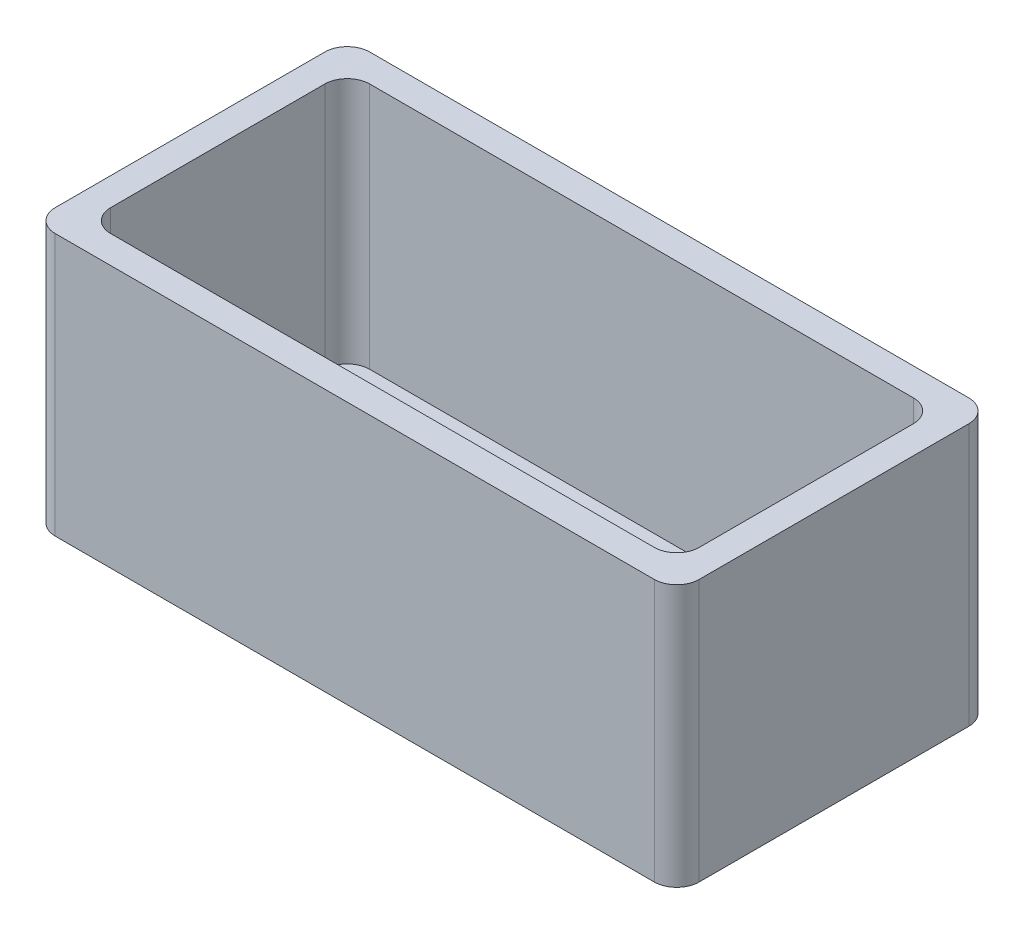
ISO-10303-21;
HEADER;
FILE_DESCRIPTION(('STEP AP214'),'2;1');
FILE_NAME('part.step','',(''),(''),'','','');
FILE_SCHEMA(('AUTOMOTIVE_DESIGN { 1 0 10303 214 1 1 1 1 }'));
ENDSEC;
DATA;
#1=APPLICATION_CONTEXT('core data for automotive mechanical design processes');
#2=APPLICATION_PROTOCOL_DEFINITION('international standard','automotive_design',2000,#1);
#3=PRODUCT_CONTEXT('',#1,'mechanical');
#4=PRODUCT('Part','Part','',(#3));
#5=PRODUCT_RELATED_PRODUCT_CATEGORY('part','',(#4));
#6=PRODUCT_DEFINITION_FORMATION('','',#4);
#7=PRODUCT_DEFINITION_CONTEXT('part definition',#1,'design');
#8=PRODUCT_DEFINITION('design','',#6,#7);
#9=PRODUCT_DEFINITION_SHAPE('','',#8);
#10=(LENGTH_UNIT() NAMED_UNIT(*) SI_UNIT(.MILLI.,.METRE.));
#11=(NAMED_UNIT(*) PLANE_ANGLE_UNIT() SI_UNIT($,.RADIAN.));
#12=(NAMED_UNIT(*) SI_UNIT($,.STERADIAN.) SOLID_ANGLE_UNIT());
#13=UNCERTAINTY_MEASURE_WITH_UNIT(LENGTH_MEASURE(1.E-05),#10,'distance_accuracy_value','');
#14=(GEOMETRIC_REPRESENTATION_CONTEXT(3) GLOBAL_UNCERTAINTY_ASSIGNED_CONTEXT((#13)) GLOBAL_UNIT_ASSIGNED_CONTEXT((#10,
#11,#12)) REPRESENTATION_CONTEXT('',''));
#15=CARTESIAN_POINT('',(0.,0.,0.));
#16=DIRECTION('',(0.,0.,1.));
#17=DIRECTION('',(1.,0.,0.));
#18=AXIS2_PLACEMENT_3D('',#15,#16,#17);
#19=CARTESIAN_POINT('',(0.,35.,0.));
#20=DIRECTION('',(0.,-1.,0.));
#21=DIRECTION('',(0.,0.,-1.));
#22=AXIS2_PLACEMENT_3D('',#19,#20,#21);
#23=PLANE('',#22);
#24=CARTESIAN_POINT('',(79.3,35.,-6.7));
#25=DIRECTION('',(0.,1.,0.));
#26=DIRECTION('',(0.,0.,1.));
#27=AXIS2_PLACEMENT_3D('',#24,#25,#26);
#28=CIRCLE('',#27,3.);
#29=CARTESIAN_POINT('',(79.3,35.,-3.7));
#30=VERTEX_POINT('',#29);
#31=CARTESIAN_POINT('',(82.3,35.,-6.7));
#32=VERTEX_POINT('',#31);
#33=EDGE_CURVE('E378',#30,#32,#28,.T.);
#34=ORIENTED_EDGE('',*,*,#33,.F.);
#35=DIRECTION('',(1.,0.,0.));
#36=VECTOR('',#35,1.);
#37=CARTESIAN_POINT('',(6.70000000000002,35.,-3.7));
#38=LINE('',#37,#36);
#39=CARTESIAN_POINT('',(6.70000000000002,35.,-3.7));
#40=VERTEX_POINT('',#39);
#41=EDGE_CURVE('E167',#40,#30,#38,.T.);
#42=ORIENTED_EDGE('',*,*,#41,.F.);
#43=CARTESIAN_POINT('',(6.7,35.,-6.7));
#44=DIRECTION('',(0.,1.,0.));
#45=DIRECTION('',(0.,0.,-1.));
#46=AXIS2_PLACEMENT_3D('',#43,#44,#45);
#47=CIRCLE('',#46,3.);
#48=CARTESIAN_POINT('',(3.7,35.,-6.70000000000002));
#49=VERTEX_POINT('',#48);
#50=EDGE_CURVE('E179',#49,#40,#47,.T.);
#51=ORIENTED_EDGE('',*,*,#50,.F.);
#52=DIRECTION('',(0.,0.,1.));
#53=VECTOR('',#52,1.);
#54=CARTESIAN_POINT('',(3.7,35.,-35.3));
#55=LINE('',#54,#53);
#56=CARTESIAN_POINT('',(3.7,35.,-35.3));
#57=VERTEX_POINT('',#56);
#58=EDGE_CURVE('E50',#57,#49,#55,.T.);
#59=ORIENTED_EDGE('',*,*,#58,.F.);
#60=CARTESIAN_POINT('',(6.7,35.,-35.3));
#61=DIRECTION('',(0.,1.,0.));
#62=DIRECTION('',(0.,0.,1.));
#63=AXIS2_PLACEMENT_3D('',#60,#61,#62);
#64=CIRCLE('',#63,3.);
#65=CARTESIAN_POINT('',(6.70000000000002,35.,-38.3));
#66=VERTEX_POINT('',#65);
#67=EDGE_CURVE('E175',#66,#57,#64,.T.);
#68=ORIENTED_EDGE('',*,*,#67,.F.);
#69=DIRECTION('',(-1.,0.,0.));
#70=VECTOR('',#69,1.);
#71=CARTESIAN_POINT('',(79.3,35.,-38.3));
#72=LINE('',#71,#70);
#73=CARTESIAN_POINT('',(79.3,35.,-38.3));
#74=VERTEX_POINT('',#73);
#75=EDGE_CURVE('E387',#74,#66,#72,.T.);
#76=ORIENTED_EDGE('',*,*,#75,.F.);
#77=CARTESIAN_POINT('',(79.3,35.,-35.3));
#78=DIRECTION('',(0.,1.,0.));
#79=DIRECTION('',(0.,0.,1.));
#80=AXIS2_PLACEMENT_3D('',#77,#78,#79);
#81=CIRCLE('',#80,3.);
#82=CARTESIAN_POINT('',(82.3,35.,-35.3));
#83=VERTEX_POINT('',#82);
#84=EDGE_CURVE('E384',#83,#74,#81,.T.);
#85=ORIENTED_EDGE('',*,*,#84,.F.);
#86=DIRECTION('',(0.,0.,-1.));
#87=VECTOR('',#86,1.);
#88=CARTESIAN_POINT('',(82.3,35.,-6.7));
#89=LINE('',#88,#87);
#90=EDGE_CURVE('E379',#32,#83,#89,.T.);
#91=ORIENTED_EDGE('',*,*,#90,.F.);
#92=EDGE_LOOP('',(#34,#42,#51,#59,#68,#76,#85,#91));
#93=FACE_BOUND('',#92,.T.);
#94=DIRECTION('',(1.,0.,0.));
#95=VECTOR('',#94,1.);
#96=CARTESIAN_POINT('',(0.,35.,0.));
#97=LINE('',#96,#95);
#98=CARTESIAN_POINT('',(3.,35.,0.));
#99=VERTEX_POINT('',#98);
#100=CARTESIAN_POINT('',(83.,35.,0.));
#101=VERTEX_POINT('',#100);
#102=EDGE_CURVE('E221',#99,#101,#97,.T.);
#103=ORIENTED_EDGE('',*,*,#102,.T.);
#104=CARTESIAN_POINT('',(83.,35.,-3.));
#105=DIRECTION('',(0.,-1.,0.));
#106=DIRECTION('',(0.,0.,-1.));
#107=AXIS2_PLACEMENT_3D('',#104,#105,#106);
#108=CIRCLE('',#107,3.);
#109=CARTESIAN_POINT('',(86.,35.,-3.));
#110=VERTEX_POINT('',#109);
#111=EDGE_CURVE('E263',#101,#110,#108,.F.);
#112=ORIENTED_EDGE('',*,*,#111,.T.);
#113=DIRECTION('',(0.,0.,-1.));
#114=VECTOR('',#113,1.);
#115=CARTESIAN_POINT('',(86.,35.,0.));
#116=LINE('',#115,#114);
#117=CARTESIAN_POINT('',(86.,35.,-39.));
#118=VERTEX_POINT('',#117);
#119=EDGE_CURVE('E225',#110,#118,#116,.T.);
#120=ORIENTED_EDGE('',*,*,#119,.T.);
#121=CARTESIAN_POINT('',(83.,35.,-39.));
#122=DIRECTION('',(0.,-1.,0.));
#123=DIRECTION('',(0.,0.,-1.));
#124=AXIS2_PLACEMENT_3D('',#121,#122,#123);
#125=CIRCLE('',#124,3.);
#126=CARTESIAN_POINT('',(83.,35.,-42.));
#127=VERTEX_POINT('',#126);
#128=EDGE_CURVE('E261',#118,#127,#125,.F.);
#129=ORIENTED_EDGE('',*,*,#128,.T.);
#130=DIRECTION('',(-1.,0.,0.));
#131=VECTOR('',#130,1.);
#132=CARTESIAN_POINT('',(0.,35.,-42.));
#133=LINE('',#132,#131);
#134=CARTESIAN_POINT('',(3.,35.,-42.));
#135=VERTEX_POINT('',#134);
#136=EDGE_CURVE('E228',#127,#135,#133,.T.);
#137=ORIENTED_EDGE('',*,*,#136,.T.);
#138=CARTESIAN_POINT('',(3.,35.,-39.));
#139=DIRECTION('',(0.,-1.,0.));
#140=DIRECTION('',(0.,0.,-1.));
#141=AXIS2_PLACEMENT_3D('',#138,#139,#140);
#142=CIRCLE('',#141,3.);
#143=CARTESIAN_POINT('',(0.,35.,-39.));
#144=VERTEX_POINT('',#143);
#145=EDGE_CURVE('E259',#135,#144,#142,.F.);
#146=ORIENTED_EDGE('',*,*,#145,.T.);
#147=DIRECTION('',(0.,0.,1.));
#148=VECTOR('',#147,1.);
#149=CARTESIAN_POINT('',(0.,35.,0.));
#150=LINE('',#149,#148);
#151=CARTESIAN_POINT('',(0.,35.,-3.));
#152=VERTEX_POINT('',#151);
#153=EDGE_CURVE('E218',#144,#152,#150,.T.);
#154=ORIENTED_EDGE('',*,*,#153,.T.);
#155=CARTESIAN_POINT('',(3.,35.,-3.));
#156=DIRECTION('',(0.,-1.,0.));
#157=DIRECTION('',(0.,0.,-1.));
#158=AXIS2_PLACEMENT_3D('',#155,#156,#157);
#159=CIRCLE('',#158,3.);
#160=EDGE_CURVE('E257',#152,#99,#159,.F.);
#161=ORIENTED_EDGE('',*,*,#160,.T.);
#162=EDGE_LOOP('',(#103,#112,#120,#129,#137,#146,#154,#161));
#163=FACE_BOUND('',#162,.T.);
#164=ADVANCED_FACE('F34',(#93,#163),#23,.F.);
#165=CARTESIAN_POINT('',(0.,0.,0.));
#166=DIRECTION('',(0.,-1.,0.));
#167=DIRECTION('',(0.,0.,-1.));
#168=AXIS2_PLACEMENT_3D('',#165,#166,#167);
#169=PLANE('',#168);
#170=CARTESIAN_POINT('',(8.99999999999999,0.,-10.));
#171=DIRECTION('',(0.,1.,0.));
#172=DIRECTION('',(0.,0.,1.));
#173=AXIS2_PLACEMENT_3D('',#170,#171,#172);
#174=CIRCLE('',#173,1.5);
#175=CARTESIAN_POINT('',(8.99999999999999,0.,-8.5));
#176=VERTEX_POINT('',#175);
#177=EDGE_CURVE('E214',#176,#176,#174,.T.);
#178=ORIENTED_EDGE('',*,*,#177,.T.);
#179=EDGE_LOOP('',(#178));
#180=FACE_BOUND('',#179,.T.);
#181=DIRECTION('',(0.,0.,-1.));
#182=VECTOR('',#181,1.);
#183=CARTESIAN_POINT('',(86.,0.,0.));
#184=LINE('',#183,#182);
#185=CARTESIAN_POINT('',(86.,0.,-3.));
#186=VERTEX_POINT('',#185);
#187=CARTESIAN_POINT('',(86.,0.,-39.));
#188=VERTEX_POINT('',#187);
#189=EDGE_CURVE('E236',#186,#188,#184,.T.);
#190=ORIENTED_EDGE('',*,*,#189,.F.);
#191=CARTESIAN_POINT('',(83.,0.,-3.));
#192=DIRECTION('',(0.,-1.,0.));
#193=DIRECTION('',(0.,0.,-1.));
#194=AXIS2_PLACEMENT_3D('',#191,#192,#193);
#195=CIRCLE('',#194,3.);
#196=CARTESIAN_POINT('',(83.,0.,0.));
#197=VERTEX_POINT('',#196);
#198=EDGE_CURVE('E250',#186,#197,#195,.T.);
#199=ORIENTED_EDGE('',*,*,#198,.T.);
#200=DIRECTION('',(1.,0.,0.));
#201=VECTOR('',#200,1.);
#202=CARTESIAN_POINT('',(0.,0.,0.));
#203=LINE('',#202,#201);
#204=CARTESIAN_POINT('',(3.,0.,0.));
#205=VERTEX_POINT('',#204);
#206=EDGE_CURVE('E233',#205,#197,#203,.T.);
#207=ORIENTED_EDGE('',*,*,#206,.F.);
#208=CARTESIAN_POINT('',(3.,0.,-3.));
#209=DIRECTION('',(0.,-1.,0.));
#210=DIRECTION('',(0.,0.,-1.));
#211=AXIS2_PLACEMENT_3D('',#208,#209,#210);
#212=CIRCLE('',#211,3.);
#213=CARTESIAN_POINT('',(0.,0.,-3.));
#214=VERTEX_POINT('',#213);
#215=EDGE_CURVE('E244',#205,#214,#212,.T.);
#216=ORIENTED_EDGE('',*,*,#215,.T.);
#217=DIRECTION('',(0.,0.,1.));
#218=VECTOR('',#217,1.);
#219=CARTESIAN_POINT('',(0.,0.,0.));
#220=LINE('',#219,#218);
#221=CARTESIAN_POINT('',(0.,0.,-39.));
#222=VERTEX_POINT('',#221);
#223=EDGE_CURVE('E217',#222,#214,#220,.T.);
#224=ORIENTED_EDGE('',*,*,#223,.F.);
#225=CARTESIAN_POINT('',(3.,0.,-39.));
#226=DIRECTION('',(0.,-1.,0.));
#227=DIRECTION('',(0.,0.,-1.));
#228=AXIS2_PLACEMENT_3D('',#225,#226,#227);
#229=CIRCLE('',#228,3.);
#230=CARTESIAN_POINT('',(3.,0.,-42.));
#231=VERTEX_POINT('',#230);
#232=EDGE_CURVE('E246',#222,#231,#229,.T.);
#233=ORIENTED_EDGE('',*,*,#232,.T.);
#234=DIRECTION('',(-1.,0.,0.));
#235=VECTOR('',#234,1.);
#236=CARTESIAN_POINT('',(0.,0.,-42.));
#237=LINE('',#236,#235);
#238=CARTESIAN_POINT('',(83.,0.,-42.));
#239=VERTEX_POINT('',#238);
#240=EDGE_CURVE('E222',#239,#231,#237,.T.);
#241=ORIENTED_EDGE('',*,*,#240,.F.);
#242=CARTESIAN_POINT('',(83.,0.,-39.));
#243=DIRECTION('',(0.,-1.,0.));
#244=DIRECTION('',(0.,0.,-1.));
#245=AXIS2_PLACEMENT_3D('',#242,#243,#244);
#246=CIRCLE('',#245,3.);
#247=EDGE_CURVE('E248',#239,#188,#246,.T.);
#248=ORIENTED_EDGE('',*,*,#247,.T.);
#249=EDGE_LOOP('',(#190,#199,#207,#216,#224,#233,#241,#248));
#250=FACE_BOUND('',#249,.T.);
#251=CARTESIAN_POINT('',(77.,0.,-10.));
#252=DIRECTION('',(0.,1.,0.));
#253=DIRECTION('',(0.,0.,1.));
#254=AXIS2_PLACEMENT_3D('',#251,#252,#253);
#255=CIRCLE('',#254,1.5);
#256=CARTESIAN_POINT('',(77.,0.,-8.50000000000001));
#257=VERTEX_POINT('',#256);
#258=EDGE_CURVE('E211',#257,#257,#255,.T.);
#259=ORIENTED_EDGE('',*,*,#258,.T.);
#260=EDGE_LOOP('',(#259));
#261=FACE_BOUND('',#260,.T.);
#262=ADVANCED_FACE('F287',(#180,#250,#261),#169,.T.);
#263=CARTESIAN_POINT('',(0.,35.,0.));
#264=DIRECTION('',(1.,0.,0.));
#265=DIRECTION('',(0.,0.,-1.));
#266=AXIS2_PLACEMENT_3D('',#263,#264,#265);
#267=PLANE('',#266);
#268=ORIENTED_EDGE('',*,*,#153,.F.);
#269=DIRECTION('',(0.,-1.,0.));
#270=VECTOR('',#269,1.);
#271=CARTESIAN_POINT('',(0.,35.,-39.));
#272=LINE('',#271,#270);
#273=EDGE_CURVE('E12',#144,#222,#272,.T.);
#274=ORIENTED_EDGE('',*,*,#273,.T.);
#275=ORIENTED_EDGE('',*,*,#223,.T.);
#276=DIRECTION('',(0.,-1.,0.));
#277=VECTOR('',#276,1.);
#278=CARTESIAN_POINT('',(0.,35.,-3.));
#279=LINE('',#278,#277);
#280=EDGE_CURVE('E43',#214,#152,#279,.F.);
#281=ORIENTED_EDGE('',*,*,#280,.T.);
#282=EDGE_LOOP('',(#268,#274,#275,#281));
#283=FACE_BOUND('',#282,.T.);
#284=ADVANCED_FACE('F272',(#283),#267,.F.);
#285=CARTESIAN_POINT('',(0.,35.,0.));
#286=DIRECTION('',(0.,0.,-1.));
#287=DIRECTION('',(-1.,0.,0.));
#288=AXIS2_PLACEMENT_3D('',#285,#286,#287);
#289=PLANE('',#288);
#290=ORIENTED_EDGE('',*,*,#206,.T.);
#291=DIRECTION('',(0.,-1.,0.));
#292=VECTOR('',#291,1.);
#293=CARTESIAN_POINT('',(83.,35.,0.));
#294=LINE('',#293,#292);
#295=EDGE_CURVE('E255',#197,#101,#294,.F.);
#296=ORIENTED_EDGE('',*,*,#295,.T.);
#297=ORIENTED_EDGE('',*,*,#102,.F.);
#298=DIRECTION('',(0.,-1.,0.));
#299=VECTOR('',#298,1.);
#300=CARTESIAN_POINT('',(3.,35.,0.));
#301=LINE('',#300,#299);
#302=EDGE_CURVE('E252',#99,#205,#301,.T.);
#303=ORIENTED_EDGE('',*,*,#302,.T.);
#304=EDGE_LOOP('',(#290,#296,#297,#303));
#305=FACE_BOUND('',#304,.T.);
#306=ADVANCED_FACE('F283',(#305),#289,.F.);
#307=CARTESIAN_POINT('',(86.,35.,0.));
#308=DIRECTION('',(-1.,0.,0.));
#309=DIRECTION('',(0.,0.,1.));
#310=AXIS2_PLACEMENT_3D('',#307,#308,#309);
#311=PLANE('',#310);
#312=ORIENTED_EDGE('',*,*,#119,.F.);
#313=DIRECTION('',(0.,-1.,0.));
#314=VECTOR('',#313,1.);
#315=CARTESIAN_POINT('',(86.,35.,-3.));
#316=LINE('',#315,#314);
#317=EDGE_CURVE('E241',#110,#186,#316,.T.);
#318=ORIENTED_EDGE('',*,*,#317,.T.);
#319=ORIENTED_EDGE('',*,*,#189,.T.);
#320=DIRECTION('',(0.,-1.,0.));
#321=VECTOR('',#320,1.);
#322=CARTESIAN_POINT('',(86.,35.,-39.));
#323=LINE('',#322,#321);
#324=EDGE_CURVE('E230',#188,#118,#323,.F.);
#325=ORIENTED_EDGE('',*,*,#324,.T.);
#326=EDGE_LOOP('',(#312,#318,#319,#325));
#327=FACE_BOUND('',#326,.T.);
#328=ADVANCED_FACE('F295',(#327),#311,.F.);
#329=CARTESIAN_POINT('',(0.,35.,-42.));
#330=DIRECTION('',(0.,0.,1.));
#331=DIRECTION('',(1.,0.,0.));
#332=AXIS2_PLACEMENT_3D('',#329,#330,#331);
#333=PLANE('',#332);
#334=ORIENTED_EDGE('',*,*,#136,.F.);
#335=DIRECTION('',(0.,-1.,0.));
#336=VECTOR('',#335,1.);
#337=CARTESIAN_POINT('',(83.,35.,-42.));
#338=LINE('',#337,#336);
#339=EDGE_CURVE('E266',#127,#239,#338,.T.);
#340=ORIENTED_EDGE('',*,*,#339,.T.);
#341=ORIENTED_EDGE('',*,*,#240,.T.);
#342=DIRECTION('',(0.,-1.,0.));
#343=VECTOR('',#342,1.);
#344=CARTESIAN_POINT('',(3.,35.,-42.));
#345=LINE('',#344,#343);
#346=EDGE_CURVE('E58',#231,#135,#345,.F.);
#347=ORIENTED_EDGE('',*,*,#346,.T.);
#348=EDGE_LOOP('',(#334,#340,#341,#347));
#349=FACE_BOUND('',#348,.T.);
#350=ADVANCED_FACE('F302',(#349),#333,.F.);
#351=CARTESIAN_POINT('',(8.99999999999999,35.,-10.));
#352=DIRECTION('',(0.,-1.,0.));
#353=DIRECTION('',(0.,0.,-1.));
#354=AXIS2_PLACEMENT_3D('',#351,#352,#353);
#355=CYLINDRICAL_SURFACE('',#354,1.5);
#356=CARTESIAN_POINT('',(8.99999999999999,2.,-10.));
#357=DIRECTION('',(0.,-1.,0.));
#358=DIRECTION('',(0.,0.,-1.));
#359=AXIS2_PLACEMENT_3D('',#356,#357,#358);
#360=CIRCLE('',#359,1.5);
#361=CARTESIAN_POINT('',(8.99999999999999,2.,-11.5));
#362=VERTEX_POINT('',#361);
#363=EDGE_CURVE('E208',#362,#362,#360,.T.);
#364=ORIENTED_EDGE('',*,*,#363,.F.);
#365=EDGE_LOOP('',(#364));
#366=FACE_BOUND('',#365,.T.);
#367=ORIENTED_EDGE('',*,*,#177,.F.);
#368=EDGE_LOOP('',(#367));
#369=FACE_BOUND('',#368,.T.);
#370=ADVANCED_FACE('F320',(#366,#369),#355,.F.);
#371=CARTESIAN_POINT('',(77.,35.,-10.));
#372=DIRECTION('',(0.,-1.,0.));
#373=DIRECTION('',(0.,0.,-1.));
#374=AXIS2_PLACEMENT_3D('',#371,#372,#373);
#375=CYLINDRICAL_SURFACE('',#374,1.5);
#376=CARTESIAN_POINT('',(77.,2.,-10.));
#377=DIRECTION('',(0.,-1.,0.));
#378=DIRECTION('',(0.,0.,-1.));
#379=AXIS2_PLACEMENT_3D('',#376,#377,#378);
#380=CIRCLE('',#379,1.5);
#381=CARTESIAN_POINT('',(77.,2.,-11.5));
#382=VERTEX_POINT('',#381);
#383=EDGE_CURVE('E38',#382,#382,#380,.T.);
#384=ORIENTED_EDGE('',*,*,#383,.F.);
#385=EDGE_LOOP('',(#384));
#386=FACE_BOUND('',#385,.T.);
#387=ORIENTED_EDGE('',*,*,#258,.F.);
#388=EDGE_LOOP('',(#387));
#389=FACE_BOUND('',#388,.T.);
#390=ADVANCED_FACE('F332',(#386,#389),#375,.F.);
#391=CARTESIAN_POINT('',(83.,35.,-3.));
#392=DIRECTION('',(0.,-1.,0.));
#393=DIRECTION('',(0.,0.,-1.));
#394=AXIS2_PLACEMENT_3D('',#391,#392,#393);
#395=CYLINDRICAL_SURFACE('',#394,3.);
#396=ORIENTED_EDGE('',*,*,#111,.F.);
#397=ORIENTED_EDGE('',*,*,#295,.F.);
#398=ORIENTED_EDGE('',*,*,#198,.F.);
#399=ORIENTED_EDGE('',*,*,#317,.F.);
#400=EDGE_LOOP('',(#396,#397,#398,#399));
#401=FACE_BOUND('',#400,.T.);
#402=ADVANCED_FACE('F292',(#401),#395,.T.);
#403=CARTESIAN_POINT('',(83.,35.,-39.));
#404=DIRECTION('',(0.,-1.,0.));
#405=DIRECTION('',(0.,0.,-1.));
#406=AXIS2_PLACEMENT_3D('',#403,#404,#405);
#407=CYLINDRICAL_SURFACE('',#406,3.);
#408=ORIENTED_EDGE('',*,*,#128,.F.);
#409=ORIENTED_EDGE('',*,*,#324,.F.);
#410=ORIENTED_EDGE('',*,*,#247,.F.);
#411=ORIENTED_EDGE('',*,*,#339,.F.);
#412=EDGE_LOOP('',(#408,#409,#410,#411));
#413=FACE_BOUND('',#412,.T.);
#414=ADVANCED_FACE('F300',(#413),#407,.T.);
#415=CARTESIAN_POINT('',(3.,35.,-39.));
#416=DIRECTION('',(0.,-1.,0.));
#417=DIRECTION('',(0.,0.,-1.));
#418=AXIS2_PLACEMENT_3D('',#415,#416,#417);
#419=CYLINDRICAL_SURFACE('',#418,3.);
#420=ORIENTED_EDGE('',*,*,#145,.F.);
#421=ORIENTED_EDGE('',*,*,#346,.F.);
#422=ORIENTED_EDGE('',*,*,#232,.F.);
#423=ORIENTED_EDGE('',*,*,#273,.F.);
#424=EDGE_LOOP('',(#420,#421,#422,#423));
#425=FACE_BOUND('',#424,.T.);
#426=ADVANCED_FACE('F304',(#425),#419,.T.);
#427=CARTESIAN_POINT('',(3.,35.,-3.));
#428=DIRECTION('',(0.,-1.,0.));
#429=DIRECTION('',(0.,0.,-1.));
#430=AXIS2_PLACEMENT_3D('',#427,#428,#429);
#431=CYLINDRICAL_SURFACE('',#430,3.);
#432=ORIENTED_EDGE('',*,*,#160,.F.);
#433=ORIENTED_EDGE('',*,*,#280,.F.);
#434=ORIENTED_EDGE('',*,*,#215,.F.);
#435=ORIENTED_EDGE('',*,*,#302,.F.);
#436=EDGE_LOOP('',(#432,#433,#434,#435));
#437=FACE_BOUND('',#436,.T.);
#438=ADVANCED_FACE('F36',(#437),#431,.T.);
#439=CARTESIAN_POINT('',(0.,2.,0.));
#440=DIRECTION('',(0.,-1.,0.));
#441=DIRECTION('',(0.,0.,-1.));
#442=AXIS2_PLACEMENT_3D('',#439,#440,#441);
#443=PLANE('',#442);
#444=ORIENTED_EDGE('',*,*,#363,.T.);
#445=EDGE_LOOP('',(#444));
#446=FACE_BOUND('',#445,.T.);
#447=ORIENTED_EDGE('',*,*,#383,.T.);
#448=EDGE_LOOP('',(#447));
#449=FACE_BOUND('',#448,.T.);
#450=CARTESIAN_POINT('',(6.7,2.,-6.7));
#451=DIRECTION('',(0.,-1.,0.));
#452=DIRECTION('',(0.,0.,-1.));
#453=AXIS2_PLACEMENT_3D('',#450,#451,#452);
#454=CIRCLE('',#453,3.);
#455=CARTESIAN_POINT('',(3.7,2.,-6.70000000000003));
#456=VERTEX_POINT('',#455);
#457=CARTESIAN_POINT('',(6.70000000000002,2.,-3.7));
#458=VERTEX_POINT('',#457);
#459=EDGE_CURVE('E172',#456,#458,#454,.F.);
#460=ORIENTED_EDGE('',*,*,#459,.T.);
#461=DIRECTION('',(1.,0.,0.));
#462=VECTOR('',#461,1.);
#463=CARTESIAN_POINT('',(6.70000000000002,2.,-3.7));
#464=LINE('',#463,#462);
#465=CARTESIAN_POINT('',(79.3,2.,-3.7));
#466=VERTEX_POINT('',#465);
#467=EDGE_CURVE('E164',#458,#466,#464,.T.);
#468=ORIENTED_EDGE('',*,*,#467,.T.);
#469=CARTESIAN_POINT('',(79.3,2.,-6.7));
#470=DIRECTION('',(0.,-1.,0.));
#471=DIRECTION('',(0.,0.,-1.));
#472=AXIS2_PLACEMENT_3D('',#469,#470,#471);
#473=CIRCLE('',#472,3.);
#474=CARTESIAN_POINT('',(82.3,2.,-6.7));
#475=VERTEX_POINT('',#474);
#476=EDGE_CURVE('E151',#466,#475,#473,.F.);
#477=ORIENTED_EDGE('',*,*,#476,.T.);
#478=DIRECTION('',(0.,0.,-1.));
#479=VECTOR('',#478,1.);
#480=CARTESIAN_POINT('',(82.3,2.,-6.7));
#481=LINE('',#480,#479);
#482=CARTESIAN_POINT('',(82.3,2.,-35.3));
#483=VERTEX_POINT('',#482);
#484=EDGE_CURVE('E199',#475,#483,#481,.T.);
#485=ORIENTED_EDGE('',*,*,#484,.T.);
#486=CARTESIAN_POINT('',(79.3,2.,-35.3));
#487=DIRECTION('',(0.,-1.,0.));
#488=DIRECTION('',(0.,0.,-1.));
#489=AXIS2_PLACEMENT_3D('',#486,#487,#488);
#490=CIRCLE('',#489,3.);
#491=CARTESIAN_POINT('',(79.3,2.,-38.3));
#492=VERTEX_POINT('',#491);
#493=EDGE_CURVE('E195',#483,#492,#490,.F.);
#494=ORIENTED_EDGE('',*,*,#493,.T.);
#495=DIRECTION('',(-1.,0.,0.));
#496=VECTOR('',#495,1.);
#497=CARTESIAN_POINT('',(79.3,2.,-38.3));
#498=LINE('',#497,#496);
#499=CARTESIAN_POINT('',(6.70000000000003,2.,-38.3));
#500=VERTEX_POINT('',#499);
#501=EDGE_CURVE('E191',#492,#500,#498,.T.);
#502=ORIENTED_EDGE('',*,*,#501,.T.);
#503=CARTESIAN_POINT('',(6.7,2.,-35.3));
#504=DIRECTION('',(0.,-1.,0.));
#505=DIRECTION('',(0.,0.,-1.));
#506=AXIS2_PLACEMENT_3D('',#503,#504,#505);
#507=CIRCLE('',#506,3.);
#508=CARTESIAN_POINT('',(3.7,2.,-35.3));
#509=VERTEX_POINT('',#508);
#510=EDGE_CURVE('E187',#500,#509,#507,.F.);
#511=ORIENTED_EDGE('',*,*,#510,.T.);
#512=DIRECTION('',(0.,0.,1.));
#513=VECTOR('',#512,1.);
#514=CARTESIAN_POINT('',(3.7,2.,-35.3));
#515=LINE('',#514,#513);
#516=EDGE_CURVE('E184',#509,#456,#515,.T.);
#517=ORIENTED_EDGE('',*,*,#516,.T.);
#518=EDGE_LOOP('',(#460,#468,#477,#485,#494,#502,#511,#517));
#519=FACE_BOUND('',#518,.T.);
#520=ADVANCED_FACE('F170',(#446,#449,#519),#443,.F.);
#521=CARTESIAN_POINT('',(6.70000000000002,-85.878518850758,-3.7));
#522=DIRECTION('',(0.,0.,1.));
#523=DIRECTION('',(1.,0.,0.));
#524=AXIS2_PLACEMENT_3D('',#521,#522,#523);
#525=PLANE('',#524);
#526=DIRECTION('',(0.,1.,0.));
#527=VECTOR('',#526,1.);
#528=CARTESIAN_POINT('',(6.70000000000002,-85.878518850758,-3.7));
#529=LINE('',#528,#527);
#530=EDGE_CURVE('E182',#458,#40,#529,.T.);
#531=ORIENTED_EDGE('',*,*,#530,.T.);
#532=ORIENTED_EDGE('',*,*,#41,.T.);
#533=DIRECTION('',(0.,1.,0.));
#534=VECTOR('',#533,1.);
#535=CARTESIAN_POINT('',(79.3,-85.878518850758,-3.7));
#536=LINE('',#535,#534);
#537=EDGE_CURVE('E155',#466,#30,#536,.T.);
#538=ORIENTED_EDGE('',*,*,#537,.F.);
#539=ORIENTED_EDGE('',*,*,#467,.F.);
#540=EDGE_LOOP('',(#531,#532,#538,#539));
#541=FACE_BOUND('',#540,.T.);
#542=ADVANCED_FACE('F163',(#541),#525,.F.);
#543=CARTESIAN_POINT('',(79.3,-85.878518850758,-6.7));
#544=DIRECTION('',(0.,1.,0.));
#545=DIRECTION('',(0.,0.,1.));
#546=AXIS2_PLACEMENT_3D('',#543,#544,#545);
#547=CYLINDRICAL_SURFACE('',#546,3.);
#548=ORIENTED_EDGE('',*,*,#537,.T.);
#549=ORIENTED_EDGE('',*,*,#33,.T.);
#550=DIRECTION('',(0.,1.,0.));
#551=VECTOR('',#550,1.);
#552=CARTESIAN_POINT('',(82.3,-85.878518850758,-6.7));
#553=LINE('',#552,#551);
#554=EDGE_CURVE('E157',#475,#32,#553,.T.);
#555=ORIENTED_EDGE('',*,*,#554,.F.);
#556=ORIENTED_EDGE('',*,*,#476,.F.);
#557=EDGE_LOOP('',(#548,#549,#555,#556));
#558=FACE_BOUND('',#557,.T.);
#559=ADVANCED_FACE('F153',(#558),#547,.F.);
#560=CARTESIAN_POINT('',(82.3,-85.878518850758,-6.7));
#561=DIRECTION('',(1.,0.,0.));
#562=DIRECTION('',(0.,0.,-1.));
#563=AXIS2_PLACEMENT_3D('',#560,#561,#562);
#564=PLANE('',#563);
#565=ORIENTED_EDGE('',*,*,#554,.T.);
#566=ORIENTED_EDGE('',*,*,#90,.T.);
#567=DIRECTION('',(0.,1.,0.));
#568=VECTOR('',#567,1.);
#569=CARTESIAN_POINT('',(82.3,-85.878518850758,-35.3));
#570=LINE('',#569,#568);
#571=EDGE_CURVE('E198',#483,#83,#570,.T.);
#572=ORIENTED_EDGE('',*,*,#571,.F.);
#573=ORIENTED_EDGE('',*,*,#484,.F.);
#574=EDGE_LOOP('',(#565,#566,#572,#573));
#575=FACE_BOUND('',#574,.T.);
#576=ADVANCED_FACE('F351',(#575),#564,.F.);
#577=CARTESIAN_POINT('',(79.3,-85.878518850758,-35.3));
#578=DIRECTION('',(0.,1.,0.));
#579=DIRECTION('',(0.,0.,1.));
#580=AXIS2_PLACEMENT_3D('',#577,#578,#579);
#581=CYLINDRICAL_SURFACE('',#580,3.);
#582=ORIENTED_EDGE('',*,*,#571,.T.);
#583=ORIENTED_EDGE('',*,*,#84,.T.);
#584=DIRECTION('',(0.,1.,0.));
#585=VECTOR('',#584,1.);
#586=CARTESIAN_POINT('',(79.3,-85.878518850758,-38.3));
#587=LINE('',#586,#585);
#588=EDGE_CURVE('E194',#492,#74,#587,.T.);
#589=ORIENTED_EDGE('',*,*,#588,.F.);
#590=ORIENTED_EDGE('',*,*,#493,.F.);
#591=EDGE_LOOP('',(#582,#583,#589,#590));
#592=FACE_BOUND('',#591,.T.);
#593=ADVANCED_FACE('F354',(#592),#581,.F.);
#594=CARTESIAN_POINT('',(79.3,-85.878518850758,-38.3));
#595=DIRECTION('',(0.,0.,-1.));
#596=DIRECTION('',(-1.,0.,0.));
#597=AXIS2_PLACEMENT_3D('',#594,#595,#596);
#598=PLANE('',#597);
#599=ORIENTED_EDGE('',*,*,#588,.T.);
#600=ORIENTED_EDGE('',*,*,#75,.T.);
#601=DIRECTION('',(0.,1.,0.));
#602=VECTOR('',#601,1.);
#603=CARTESIAN_POINT('',(6.70000000000002,-85.878518850758,-38.3));
#604=LINE('',#603,#602);
#605=EDGE_CURVE('E190',#500,#66,#604,.T.);
#606=ORIENTED_EDGE('',*,*,#605,.F.);
#607=ORIENTED_EDGE('',*,*,#501,.F.);
#608=EDGE_LOOP('',(#599,#600,#606,#607));
#609=FACE_BOUND('',#608,.T.);
#610=ADVANCED_FACE('F358',(#609),#598,.F.);
#611=CARTESIAN_POINT('',(6.7,-85.878518850758,-35.3));
#612=DIRECTION('',(0.,1.,0.));
#613=DIRECTION('',(0.,0.,1.));
#614=AXIS2_PLACEMENT_3D('',#611,#612,#613);
#615=CYLINDRICAL_SURFACE('',#614,3.);
#616=ORIENTED_EDGE('',*,*,#605,.T.);
#617=ORIENTED_EDGE('',*,*,#67,.T.);
#618=DIRECTION('',(0.,1.,0.));
#619=VECTOR('',#618,1.);
#620=CARTESIAN_POINT('',(3.7,-85.878518850758,-35.3));
#621=LINE('',#620,#619);
#622=EDGE_CURVE('E186',#509,#57,#621,.T.);
#623=ORIENTED_EDGE('',*,*,#622,.F.);
#624=ORIENTED_EDGE('',*,*,#510,.F.);
#625=EDGE_LOOP('',(#616,#617,#623,#624));
#626=FACE_BOUND('',#625,.T.);
#627=ADVANCED_FACE('F362',(#626),#615,.F.);
#628=CARTESIAN_POINT('',(3.7,-85.878518850758,-35.3));
#629=DIRECTION('',(-1.,0.,0.));
#630=DIRECTION('',(0.,0.,1.));
#631=AXIS2_PLACEMENT_3D('',#628,#629,#630);
#632=PLANE('',#631);
#633=ORIENTED_EDGE('',*,*,#622,.T.);
#634=ORIENTED_EDGE('',*,*,#58,.T.);
#635=DIRECTION('',(0.,1.,0.));
#636=VECTOR('',#635,1.);
#637=CARTESIAN_POINT('',(3.7,-85.878518850758,-6.70000000000002));
#638=LINE('',#637,#636);
#639=EDGE_CURVE('E183',#456,#49,#638,.T.);
#640=ORIENTED_EDGE('',*,*,#639,.F.);
#641=ORIENTED_EDGE('',*,*,#516,.F.);
#642=EDGE_LOOP('',(#633,#634,#640,#641));
#643=FACE_BOUND('',#642,.T.);
#644=ADVANCED_FACE('F366',(#643),#632,.F.);
#645=CARTESIAN_POINT('',(6.7,-85.878518850758,-6.7));
#646=DIRECTION('',(0.,1.,0.));
#647=DIRECTION('',(0.,0.,1.));
#648=AXIS2_PLACEMENT_3D('',#645,#646,#647);
#649=CYLINDRICAL_SURFACE('',#648,3.);
#650=ORIENTED_EDGE('',*,*,#639,.T.);
#651=ORIENTED_EDGE('',*,*,#50,.T.);
#652=ORIENTED_EDGE('',*,*,#530,.F.);
#653=ORIENTED_EDGE('',*,*,#459,.F.);
#654=EDGE_LOOP('',(#650,#651,#652,#653));
#655=FACE_BOUND('',#654,.T.);
#656=ADVANCED_FACE('F370',(#655),#649,.F.);
#657=CLOSED_SHELL('',(#164,#262,#284,#306,#328,#350,#370,#390,#402,#414,#426,#438,#520,#542,
#559,#576,#593,#610,#627,#644,#656));
#658=MANIFOLD_SOLID_BREP('B2',#657);
#659=ADVANCED_BREP_SHAPE_REPRESENTATION('',(#18,#658),#14);
#660=SHAPE_DEFINITION_REPRESENTATION(#9,#659);
ENDSEC;
END-ISO-10303-21;
